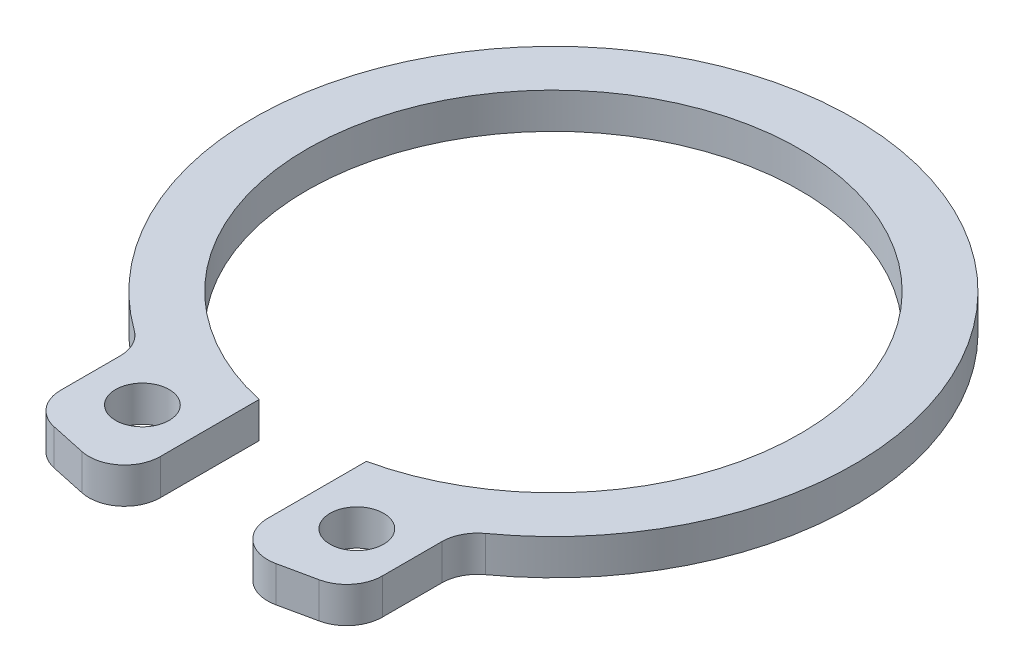
ISO-10303-21;
HEADER;
FILE_DESCRIPTION(('STEP AP214'),'2;1');
FILE_NAME('part.step','',(''),(''),'','','');
FILE_SCHEMA(('AUTOMOTIVE_DESIGN { 1 0 10303 214 1 1 1 1 }'));
ENDSEC;
DATA;
#1=APPLICATION_CONTEXT('core data for automotive mechanical design processes');
#2=APPLICATION_PROTOCOL_DEFINITION('international standard','automotive_design',2000,#1);
#3=PRODUCT_CONTEXT('',#1,'mechanical');
#4=PRODUCT('Part','Part','',(#3));
#5=PRODUCT_RELATED_PRODUCT_CATEGORY('part','',(#4));
#6=PRODUCT_DEFINITION_FORMATION('','',#4);
#7=PRODUCT_DEFINITION_CONTEXT('part definition',#1,'design');
#8=PRODUCT_DEFINITION('design','',#6,#7);
#9=PRODUCT_DEFINITION_SHAPE('','',#8);
#10=(LENGTH_UNIT() NAMED_UNIT(*) SI_UNIT(.MILLI.,.METRE.));
#11=(NAMED_UNIT(*) PLANE_ANGLE_UNIT() SI_UNIT($,.RADIAN.));
#12=(NAMED_UNIT(*) SI_UNIT($,.STERADIAN.) SOLID_ANGLE_UNIT());
#13=UNCERTAINTY_MEASURE_WITH_UNIT(LENGTH_MEASURE(1.E-05),#10,'distance_accuracy_value','');
#14=(GEOMETRIC_REPRESENTATION_CONTEXT(3) GLOBAL_UNCERTAINTY_ASSIGNED_CONTEXT((#13)) GLOBAL_UNIT_ASSIGNED_CONTEXT((#10,
#11,#12)) REPRESENTATION_CONTEXT('',''));
#15=CARTESIAN_POINT('',(0.,0.,0.));
#16=DIRECTION('',(0.,0.,1.));
#17=DIRECTION('',(1.,0.,0.));
#18=AXIS2_PLACEMENT_3D('',#15,#16,#17);
#19=CARTESIAN_POINT('',(0.,1.,0.));
#20=DIRECTION('',(0.,-1.,0.));
#21=DIRECTION('',(0.,0.,-1.));
#22=AXIS2_PLACEMENT_3D('',#19,#20,#21);
#23=CYLINDRICAL_SURFACE('',#22,8.4);
#24=CARTESIAN_POINT('',(0.,1.,0.));
#25=DIRECTION('',(0.,1.,0.));
#26=DIRECTION('',(0.,0.,1.));
#27=AXIS2_PLACEMENT_3D('',#24,#25,#26);
#28=CIRCLE('',#27,8.4);
#29=CARTESIAN_POINT('',(4.91489361702128,1.,6.81203499208302));
#30=VERTEX_POINT('',#29);
#31=CARTESIAN_POINT('',(-4.91489361702127,1.,6.81203499208302));
#32=VERTEX_POINT('',#31);
#33=EDGE_CURVE('E190',#30,#32,#28,.T.);
#34=ORIENTED_EDGE('',*,*,#33,.F.);
#35=DIRECTION('',(0.,-1.,0.));
#36=VECTOR('',#35,1.);
#37=CARTESIAN_POINT('',(4.91489361702128,1.,6.81203499208302));
#38=LINE('',#37,#36);
#39=CARTESIAN_POINT('',(4.91489361702128,0.,6.81203499208302));
#40=VERTEX_POINT('',#39);
#41=EDGE_CURVE('E193',#30,#40,#38,.T.);
#42=ORIENTED_EDGE('',*,*,#41,.T.);
#43=CARTESIAN_POINT('',(0.,0.,0.));
#44=DIRECTION('',(0.,1.,0.));
#45=DIRECTION('',(0.,0.,1.));
#46=AXIS2_PLACEMENT_3D('',#43,#44,#45);
#47=CIRCLE('',#46,8.4);
#48=CARTESIAN_POINT('',(-4.91489361702127,0.,6.81203499208302));
#49=VERTEX_POINT('',#48);
#50=EDGE_CURVE('E169',#40,#49,#47,.T.);
#51=ORIENTED_EDGE('',*,*,#50,.T.);
#52=DIRECTION('',(0.,-1.,0.));
#53=VECTOR('',#52,1.);
#54=CARTESIAN_POINT('',(-4.91489361702127,1.,6.81203499208302));
#55=LINE('',#54,#53);
#56=EDGE_CURVE('E154',#49,#32,#55,.F.);
#57=ORIENTED_EDGE('',*,*,#56,.T.);
#58=EDGE_LOOP('',(#34,#42,#51,#57));
#59=FACE_BOUND('',#58,.T.);
#60=ADVANCED_FACE('F35',(#59),#23,.T.);
#61=CARTESIAN_POINT('',(-4.5,1.,7.09295425052214));
#62=DIRECTION('',(1.,0.,0.));
#63=DIRECTION('',(0.,0.,-1.));
#64=AXIS2_PLACEMENT_3D('',#61,#62,#63);
#65=PLANE('',#64);
#66=DIRECTION('',(0.,0.,1.));
#67=VECTOR('',#66,1.);
#68=CARTESIAN_POINT('',(-4.5,0.,7.09295425052214));
#69=LINE('',#68,#67);
#70=CARTESIAN_POINT('',(-4.5,0.,7.62299153875957));
#71=VERTEX_POINT('',#70);
#72=CARTESIAN_POINT('',(-4.5,0.,9.28432022909111));
#73=VERTEX_POINT('',#72);
#74=EDGE_CURVE('E172',#71,#73,#69,.T.);
#75=ORIENTED_EDGE('',*,*,#74,.T.);
#76=DIRECTION('',(0.,-1.,0.));
#77=VECTOR('',#76,1.);
#78=CARTESIAN_POINT('',(-4.5,1.,9.28432022909111));
#79=LINE('',#78,#77);
#80=CARTESIAN_POINT('',(-4.5,1.,9.28432022909111));
#81=VERTEX_POINT('',#80);
#82=EDGE_CURVE('E232',#73,#81,#79,.F.);
#83=ORIENTED_EDGE('',*,*,#82,.T.);
#84=DIRECTION('',(0.,0.,1.));
#85=VECTOR('',#84,1.);
#86=CARTESIAN_POINT('',(-4.5,1.,7.09295425052214));
#87=LINE('',#86,#85);
#88=CARTESIAN_POINT('',(-4.5,1.,7.62299153875957));
#89=VERTEX_POINT('',#88);
#90=EDGE_CURVE('E252',#89,#81,#87,.T.);
#91=ORIENTED_EDGE('',*,*,#90,.F.);
#92=DIRECTION('',(0.,1.,0.));
#93=VECTOR('',#92,1.);
#94=CARTESIAN_POINT('',(-4.5,0.,7.62299153875957));
#95=LINE('',#94,#93);
#96=EDGE_CURVE('E229',#89,#71,#95,.F.);
#97=ORIENTED_EDGE('',*,*,#96,.T.);
#98=EDGE_LOOP('',(#75,#83,#91,#97));
#99=FACE_BOUND('',#98,.T.);
#100=ADVANCED_FACE('F255',(#99),#65,.F.);
#101=CARTESIAN_POINT('',(-4.5,1.,10.0929542505221));
#102=DIRECTION('',(0.209271011198973,0.,-0.977857680785788));
#103=DIRECTION('',(-0.977857680785788,0.,-0.209271011198973));
#104=AXIS2_PLACEMENT_3D('',#101,#102,#103);
#105=PLANE('',#104);
#106=DIRECTION('',(0.977857680785788,0.,0.209271011198973));
#107=VECTOR('',#106,1.);
#108=CARTESIAN_POINT('',(-4.5,0.,10.0929542505221));
#109=LINE('',#108,#107);
#110=CARTESIAN_POINT('',(-3.70927101119897,0.,10.2621779098769));
#111=VERTEX_POINT('',#110);
#112=CARTESIAN_POINT('',(-2.70927101119897,0.,10.4761875917672));
#113=VERTEX_POINT('',#112);
#114=EDGE_CURVE('E176',#111,#113,#109,.T.);
#115=ORIENTED_EDGE('',*,*,#114,.T.);
#116=DIRECTION('',(0.,-1.,0.));
#117=VECTOR('',#116,1.);
#118=CARTESIAN_POINT('',(-2.70927101119897,1.,10.4761875917672));
#119=LINE('',#118,#117);
#120=CARTESIAN_POINT('',(-2.70927101119897,1.,10.4761875917672));
#121=VERTEX_POINT('',#120);
#122=EDGE_CURVE('E227',#113,#121,#119,.F.);
#123=ORIENTED_EDGE('',*,*,#122,.T.);
#124=DIRECTION('',(0.977857680785788,0.,0.209271011198973));
#125=VECTOR('',#124,1.);
#126=CARTESIAN_POINT('',(-4.5,1.,10.0929542505221));
#127=LINE('',#126,#125);
#128=CARTESIAN_POINT('',(-3.70927101119897,1.,10.2621779098769));
#129=VERTEX_POINT('',#128);
#130=EDGE_CURVE('E145',#129,#121,#127,.T.);
#131=ORIENTED_EDGE('',*,*,#130,.F.);
#132=DIRECTION('',(0.,-1.,0.));
#133=VECTOR('',#132,1.);
#134=CARTESIAN_POINT('',(-3.70927101119897,1.,10.2621779098769));
#135=LINE('',#134,#133);
#136=EDGE_CURVE('E224',#129,#111,#135,.T.);
#137=ORIENTED_EDGE('',*,*,#136,.T.);
#138=EDGE_LOOP('',(#115,#123,#131,#137));
#139=FACE_BOUND('',#138,.T.);
#140=ADVANCED_FACE('F301',(#139),#105,.F.);
#141=CARTESIAN_POINT('',(-1.5,1.,10.7349832961931));
#142=DIRECTION('',(-1.,0.,0.));
#143=DIRECTION('',(0.,0.,1.));
#144=AXIS2_PLACEMENT_3D('',#141,#142,#143);
#145=PLANE('',#144);
#146=DIRECTION('',(0.,0.,-1.));
#147=VECTOR('',#146,1.);
#148=CARTESIAN_POINT('',(-1.5,1.,10.7349832961931));
#149=LINE('',#148,#147);
#150=CARTESIAN_POINT('',(-1.5,1.,9.49832991098143));
#151=VERTEX_POINT('',#150);
#152=CARTESIAN_POINT('',(-1.5,1.,6.7349832961931));
#153=VERTEX_POINT('',#152);
#154=EDGE_CURVE('E135',#151,#153,#149,.T.);
#155=ORIENTED_EDGE('',*,*,#154,.F.);
#156=DIRECTION('',(0.,-1.,0.));
#157=VECTOR('',#156,1.);
#158=CARTESIAN_POINT('',(-1.5,1.,9.49832991098143));
#159=LINE('',#158,#157);
#160=CARTESIAN_POINT('',(-1.5,0.,9.49832991098143));
#161=VERTEX_POINT('',#160);
#162=EDGE_CURVE('E222',#151,#161,#159,.T.);
#163=ORIENTED_EDGE('',*,*,#162,.T.);
#164=DIRECTION('',(0.,0.,-1.));
#165=VECTOR('',#164,1.);
#166=CARTESIAN_POINT('',(-1.5,0.,10.7349832961931));
#167=LINE('',#166,#165);
#168=CARTESIAN_POINT('',(-1.5,0.,6.7349832961931));
#169=VERTEX_POINT('',#168);
#170=EDGE_CURVE('E151',#161,#169,#167,.T.);
#171=ORIENTED_EDGE('',*,*,#170,.T.);
#172=DIRECTION('',(0.,-1.,0.));
#173=VECTOR('',#172,1.);
#174=CARTESIAN_POINT('',(-1.5,1.,6.7349832961931));
#175=LINE('',#174,#173);
#176=EDGE_CURVE('E148',#153,#169,#175,.T.);
#177=ORIENTED_EDGE('',*,*,#176,.F.);
#178=EDGE_LOOP('',(#155,#163,#171,#177));
#179=FACE_BOUND('',#178,.T.);
#180=ADVANCED_FACE('F149',(#179),#145,.F.);
#181=CARTESIAN_POINT('',(0.,1.,0.));
#182=DIRECTION('',(0.,-1.,0.));
#183=DIRECTION('',(0.,0.,-1.));
#184=AXIS2_PLACEMENT_3D('',#181,#182,#183);
#185=CYLINDRICAL_SURFACE('',#184,6.9);
#186=CARTESIAN_POINT('',(0.,0.,0.));
#187=DIRECTION('',(0.,-1.,0.));
#188=DIRECTION('',(0.,0.,1.));
#189=AXIS2_PLACEMENT_3D('',#186,#187,#188);
#190=CIRCLE('',#189,6.9);
#191=CARTESIAN_POINT('',(1.5,0.,6.73498329619309));
#192=VERTEX_POINT('',#191);
#193=EDGE_CURVE('E180',#169,#192,#190,.T.);
#194=ORIENTED_EDGE('',*,*,#193,.T.);
#195=DIRECTION('',(0.,-1.,0.));
#196=VECTOR('',#195,1.);
#197=CARTESIAN_POINT('',(1.5,1.,6.73498329619309));
#198=LINE('',#197,#196);
#199=CARTESIAN_POINT('',(1.5,1.,6.73498329619309));
#200=VERTEX_POINT('',#199);
#201=EDGE_CURVE('E155',#200,#192,#198,.T.);
#202=ORIENTED_EDGE('',*,*,#201,.F.);
#203=CARTESIAN_POINT('',(0.,1.,0.));
#204=DIRECTION('',(0.,-1.,0.));
#205=DIRECTION('',(0.,0.,1.));
#206=AXIS2_PLACEMENT_3D('',#203,#204,#205);
#207=CIRCLE('',#206,6.9);
#208=EDGE_CURVE('E140',#153,#200,#207,.T.);
#209=ORIENTED_EDGE('',*,*,#208,.F.);
#210=ORIENTED_EDGE('',*,*,#176,.T.);
#211=EDGE_LOOP('',(#194,#202,#209,#210));
#212=FACE_BOUND('',#211,.T.);
#213=ADVANCED_FACE('F157',(#212),#185,.F.);
#214=CARTESIAN_POINT('',(1.5,1.,10.7349832961931));
#215=DIRECTION('',(1.,0.,0.));
#216=DIRECTION('',(0.,0.,-1.));
#217=AXIS2_PLACEMENT_3D('',#214,#215,#216);
#218=PLANE('',#217);
#219=DIRECTION('',(0.,0.,1.));
#220=VECTOR('',#219,1.);
#221=CARTESIAN_POINT('',(1.5,0.,10.7349832961931));
#222=LINE('',#221,#220);
#223=CARTESIAN_POINT('',(1.5,0.,9.49832991098143));
#224=VERTEX_POINT('',#223);
#225=EDGE_CURVE('E182',#192,#224,#222,.T.);
#226=ORIENTED_EDGE('',*,*,#225,.T.);
#227=DIRECTION('',(0.,-1.,0.));
#228=VECTOR('',#227,1.);
#229=CARTESIAN_POINT('',(1.5,1.,9.49832991098143));
#230=LINE('',#229,#228);
#231=CARTESIAN_POINT('',(1.5,1.,9.49832991098143));
#232=VERTEX_POINT('',#231);
#233=EDGE_CURVE('E50',#224,#232,#230,.F.);
#234=ORIENTED_EDGE('',*,*,#233,.T.);
#235=DIRECTION('',(0.,0.,1.));
#236=VECTOR('',#235,1.);
#237=CARTESIAN_POINT('',(1.5,1.,10.7349832961931));
#238=LINE('',#237,#236);
#239=EDGE_CURVE('E159',#200,#232,#238,.T.);
#240=ORIENTED_EDGE('',*,*,#239,.F.);
#241=ORIENTED_EDGE('',*,*,#201,.T.);
#242=EDGE_LOOP('',(#226,#234,#240,#241));
#243=FACE_BOUND('',#242,.T.);
#244=ADVANCED_FACE('F331',(#243),#218,.F.);
#245=CARTESIAN_POINT('',(4.5,1.,10.0929542505221));
#246=DIRECTION('',(-0.209271011198973,0.,-0.977857680785788));
#247=DIRECTION('',(-0.977857680785787,0.,0.209271011198973));
#248=AXIS2_PLACEMENT_3D('',#245,#246,#247);
#249=PLANE('',#248);
#250=DIRECTION('',(0.977857680785788,0.,-0.209271011198973));
#251=VECTOR('',#250,1.);
#252=CARTESIAN_POINT('',(4.5,0.,10.0929542505221));
#253=LINE('',#252,#251);
#254=CARTESIAN_POINT('',(2.70927101119897,0.,10.4761875917672));
#255=VERTEX_POINT('',#254);
#256=CARTESIAN_POINT('',(3.70927101119897,0.,10.2621779098769));
#257=VERTEX_POINT('',#256);
#258=EDGE_CURVE('E184',#255,#257,#253,.T.);
#259=ORIENTED_EDGE('',*,*,#258,.T.);
#260=DIRECTION('',(0.,-1.,0.));
#261=VECTOR('',#260,1.);
#262=CARTESIAN_POINT('',(3.70927101119897,1.,10.2621779098769));
#263=LINE('',#262,#261);
#264=CARTESIAN_POINT('',(3.70927101119897,1.,10.2621779098769));
#265=VERTEX_POINT('',#264);
#266=EDGE_CURVE('E212',#257,#265,#263,.F.);
#267=ORIENTED_EDGE('',*,*,#266,.T.);
#268=DIRECTION('',(0.977857680785788,0.,-0.209271011198973));
#269=VECTOR('',#268,1.);
#270=CARTESIAN_POINT('',(4.5,1.,10.0929542505221));
#271=LINE('',#270,#269);
#272=CARTESIAN_POINT('',(2.70927101119897,1.,10.4761875917672));
#273=VERTEX_POINT('',#272);
#274=EDGE_CURVE('E161',#273,#265,#271,.T.);
#275=ORIENTED_EDGE('',*,*,#274,.F.);
#276=DIRECTION('',(0.,-1.,0.));
#277=VECTOR('',#276,1.);
#278=CARTESIAN_POINT('',(2.70927101119897,1.,10.4761875917672));
#279=LINE('',#278,#277);
#280=EDGE_CURVE('E209',#273,#255,#279,.T.);
#281=ORIENTED_EDGE('',*,*,#280,.T.);
#282=EDGE_LOOP('',(#259,#267,#275,#281));
#283=FACE_BOUND('',#282,.T.);
#284=ADVANCED_FACE('F337',(#283),#249,.F.);
#285=CARTESIAN_POINT('',(4.5,1.,7.09295425052214));
#286=DIRECTION('',(-1.,0.,0.));
#287=DIRECTION('',(0.,0.,1.));
#288=AXIS2_PLACEMENT_3D('',#285,#286,#287);
#289=PLANE('',#288);
#290=DIRECTION('',(0.,0.,-1.));
#291=VECTOR('',#290,1.);
#292=CARTESIAN_POINT('',(4.5,0.,7.09295425052214));
#293=LINE('',#292,#291);
#294=CARTESIAN_POINT('',(4.5,0.,9.28432022909111));
#295=VERTEX_POINT('',#294);
#296=CARTESIAN_POINT('',(4.5,0.,7.62299153875957));
#297=VERTEX_POINT('',#296);
#298=EDGE_CURVE('E187',#295,#297,#293,.T.);
#299=ORIENTED_EDGE('',*,*,#298,.T.);
#300=DIRECTION('',(0.,1.,0.));
#301=VECTOR('',#300,1.);
#302=CARTESIAN_POINT('',(4.5,1.,7.62299153875957));
#303=LINE('',#302,#301);
#304=CARTESIAN_POINT('',(4.5,1.,7.62299153875957));
#305=VERTEX_POINT('',#304);
#306=EDGE_CURVE('E199',#297,#305,#303,.T.);
#307=ORIENTED_EDGE('',*,*,#306,.T.);
#308=DIRECTION('',(0.,0.,-1.));
#309=VECTOR('',#308,1.);
#310=CARTESIAN_POINT('',(4.5,1.,7.09295425052214));
#311=LINE('',#310,#309);
#312=CARTESIAN_POINT('',(4.5,1.,9.28432022909111));
#313=VERTEX_POINT('',#312);
#314=EDGE_CURVE('E166',#313,#305,#311,.T.);
#315=ORIENTED_EDGE('',*,*,#314,.F.);
#316=DIRECTION('',(0.,-1.,0.));
#317=VECTOR('',#316,1.);
#318=CARTESIAN_POINT('',(4.5,1.,9.28432022909111));
#319=LINE('',#318,#317);
#320=EDGE_CURVE('E196',#313,#295,#319,.T.);
#321=ORIENTED_EDGE('',*,*,#320,.T.);
#322=EDGE_LOOP('',(#299,#307,#315,#321));
#323=FACE_BOUND('',#322,.T.);
#324=ADVANCED_FACE('F284',(#323),#289,.F.);
#325=CARTESIAN_POINT('',(0.,1.,0.));
#326=DIRECTION('',(0.,1.,0.));
#327=DIRECTION('',(0.,0.,1.));
#328=AXIS2_PLACEMENT_3D('',#325,#326,#327);
#329=PLANE('',#328);
#330=CARTESIAN_POINT('',(-3.,1.,8.5));
#331=DIRECTION('',(0.,1.,0.));
#332=DIRECTION('',(0.,0.,1.));
#333=AXIS2_PLACEMENT_3D('',#330,#331,#332);
#334=CIRCLE('',#333,0.75);
#335=CARTESIAN_POINT('',(-3.,1.,9.25));
#336=VERTEX_POINT('',#335);
#337=EDGE_CURVE('E266',#336,#336,#334,.T.);
#338=ORIENTED_EDGE('',*,*,#337,.F.);
#339=EDGE_LOOP('',(#338));
#340=FACE_BOUND('',#339,.T.);
#341=CARTESIAN_POINT('',(3.,1.,8.5));
#342=DIRECTION('',(0.,1.,0.));
#343=DIRECTION('',(0.,0.,-1.));
#344=AXIS2_PLACEMENT_3D('',#341,#342,#343);
#345=CIRCLE('',#344,0.75);
#346=CARTESIAN_POINT('',(3.,1.,7.75));
#347=VERTEX_POINT('',#346);
#348=EDGE_CURVE('E260',#347,#347,#345,.T.);
#349=ORIENTED_EDGE('',*,*,#348,.F.);
#350=EDGE_LOOP('',(#349));
#351=FACE_BOUND('',#350,.T.);
#352=ORIENTED_EDGE('',*,*,#274,.T.);
#353=CARTESIAN_POINT('',(3.5,1.,9.28432022909111));
#354=DIRECTION('',(0.,1.,0.));
#355=DIRECTION('',(0.,0.,1.));
#356=AXIS2_PLACEMENT_3D('',#353,#354,#355);
#357=CIRCLE('',#356,1.);
#358=EDGE_CURVE('E219',#265,#313,#357,.T.);
#359=ORIENTED_EDGE('',*,*,#358,.T.);
#360=ORIENTED_EDGE('',*,*,#314,.T.);
#361=CARTESIAN_POINT('',(5.5,1.,7.62299153875957));
#362=DIRECTION('',(0.,1.,0.));
#363=DIRECTION('',(0.,0.,1.));
#364=AXIS2_PLACEMENT_3D('',#361,#362,#363);
#365=CIRCLE('',#364,1.);
#366=EDGE_CURVE('E236',#305,#30,#365,.F.);
#367=ORIENTED_EDGE('',*,*,#366,.T.);
#368=ORIENTED_EDGE('',*,*,#33,.T.);
#369=CARTESIAN_POINT('',(-5.5,1.,7.62299153875957));
#370=DIRECTION('',(0.,1.,0.));
#371=DIRECTION('',(0.,0.,1.));
#372=AXIS2_PLACEMENT_3D('',#369,#370,#371);
#373=CIRCLE('',#372,1.);
#374=EDGE_CURVE('E11',#32,#89,#373,.F.);
#375=ORIENTED_EDGE('',*,*,#374,.T.);
#376=ORIENTED_EDGE('',*,*,#90,.T.);
#377=CARTESIAN_POINT('',(-3.5,1.,9.28432022909111));
#378=DIRECTION('',(0.,1.,0.));
#379=DIRECTION('',(0.,0.,1.));
#380=AXIS2_PLACEMENT_3D('',#377,#378,#379);
#381=CIRCLE('',#380,1.);
#382=EDGE_CURVE('E214',#81,#129,#381,.T.);
#383=ORIENTED_EDGE('',*,*,#382,.T.);
#384=ORIENTED_EDGE('',*,*,#130,.T.);
#385=CARTESIAN_POINT('',(-2.5,1.,9.49832991098143));
#386=DIRECTION('',(0.,1.,0.));
#387=DIRECTION('',(0.,0.,1.));
#388=AXIS2_PLACEMENT_3D('',#385,#386,#387);
#389=CIRCLE('',#388,1.);
#390=EDGE_CURVE('E58',#121,#151,#389,.T.);
#391=ORIENTED_EDGE('',*,*,#390,.T.);
#392=ORIENTED_EDGE('',*,*,#154,.T.);
#393=ORIENTED_EDGE('',*,*,#208,.T.);
#394=ORIENTED_EDGE('',*,*,#239,.T.);
#395=CARTESIAN_POINT('',(2.5,1.,9.49832991098143));
#396=DIRECTION('',(0.,1.,0.));
#397=DIRECTION('',(0.,0.,1.));
#398=AXIS2_PLACEMENT_3D('',#395,#396,#397);
#399=CIRCLE('',#398,1.);
#400=EDGE_CURVE('E217',#232,#273,#399,.T.);
#401=ORIENTED_EDGE('',*,*,#400,.T.);
#402=EDGE_LOOP('',(#352,#359,#360,#367,#368,#375,#376,#383,#384,#391,#392,#393,#394,#401));
#403=FACE_BOUND('',#402,.T.);
#404=ADVANCED_FACE('F138',(#340,#351,#403),#329,.T.);
#405=CARTESIAN_POINT('',(0.,0.,0.));
#406=DIRECTION('',(0.,1.,0.));
#407=DIRECTION('',(0.,0.,1.));
#408=AXIS2_PLACEMENT_3D('',#405,#406,#407);
#409=PLANE('',#408);
#410=CARTESIAN_POINT('',(-3.,0.,8.5));
#411=DIRECTION('',(0.,1.,0.));
#412=DIRECTION('',(0.,0.,1.));
#413=AXIS2_PLACEMENT_3D('',#410,#411,#412);
#414=CIRCLE('',#413,0.75);
#415=CARTESIAN_POINT('',(-3.,0.,9.25));
#416=VERTEX_POINT('',#415);
#417=EDGE_CURVE('E173',#416,#416,#414,.T.);
#418=ORIENTED_EDGE('',*,*,#417,.T.);
#419=EDGE_LOOP('',(#418));
#420=FACE_BOUND('',#419,.T.);
#421=CARTESIAN_POINT('',(3.,0.,8.5));
#422=DIRECTION('',(0.,1.,0.));
#423=DIRECTION('',(0.,0.,-1.));
#424=AXIS2_PLACEMENT_3D('',#421,#422,#423);
#425=CIRCLE('',#424,0.75);
#426=CARTESIAN_POINT('',(3.,0.,7.75));
#427=VERTEX_POINT('',#426);
#428=EDGE_CURVE('E263',#427,#427,#425,.T.);
#429=ORIENTED_EDGE('',*,*,#428,.T.);
#430=EDGE_LOOP('',(#429));
#431=FACE_BOUND('',#430,.T.);
#432=ORIENTED_EDGE('',*,*,#298,.F.);
#433=CARTESIAN_POINT('',(3.5,0.,9.28432022909111));
#434=DIRECTION('',(0.,1.,0.));
#435=DIRECTION('',(0.,0.,1.));
#436=AXIS2_PLACEMENT_3D('',#433,#434,#435);
#437=CIRCLE('',#436,1.);
#438=EDGE_CURVE('E207',#295,#257,#437,.F.);
#439=ORIENTED_EDGE('',*,*,#438,.T.);
#440=ORIENTED_EDGE('',*,*,#258,.F.);
#441=CARTESIAN_POINT('',(2.5,0.,9.49832991098143));
#442=DIRECTION('',(0.,1.,0.));
#443=DIRECTION('',(0.,0.,1.));
#444=AXIS2_PLACEMENT_3D('',#441,#442,#443);
#445=CIRCLE('',#444,1.);
#446=EDGE_CURVE('E205',#255,#224,#445,.F.);
#447=ORIENTED_EDGE('',*,*,#446,.T.);
#448=ORIENTED_EDGE('',*,*,#225,.F.);
#449=ORIENTED_EDGE('',*,*,#193,.F.);
#450=ORIENTED_EDGE('',*,*,#170,.F.);
#451=CARTESIAN_POINT('',(-2.5,0.,9.49832991098143));
#452=DIRECTION('',(0.,1.,0.));
#453=DIRECTION('',(0.,0.,1.));
#454=AXIS2_PLACEMENT_3D('',#451,#452,#453);
#455=CIRCLE('',#454,1.);
#456=EDGE_CURVE('E203',#161,#113,#455,.F.);
#457=ORIENTED_EDGE('',*,*,#456,.T.);
#458=ORIENTED_EDGE('',*,*,#114,.F.);
#459=CARTESIAN_POINT('',(-3.5,0.,9.28432022909111));
#460=DIRECTION('',(0.,1.,0.));
#461=DIRECTION('',(0.,0.,1.));
#462=AXIS2_PLACEMENT_3D('',#459,#460,#461);
#463=CIRCLE('',#462,1.);
#464=EDGE_CURVE('E201',#111,#73,#463,.F.);
#465=ORIENTED_EDGE('',*,*,#464,.T.);
#466=ORIENTED_EDGE('',*,*,#74,.F.);
#467=CARTESIAN_POINT('',(-5.5,0.,7.62299153875957));
#468=DIRECTION('',(0.,1.,0.));
#469=DIRECTION('',(0.,0.,1.));
#470=AXIS2_PLACEMENT_3D('',#467,#468,#469);
#471=CIRCLE('',#470,1.);
#472=EDGE_CURVE('E43',#71,#49,#471,.T.);
#473=ORIENTED_EDGE('',*,*,#472,.T.);
#474=ORIENTED_EDGE('',*,*,#50,.F.);
#475=CARTESIAN_POINT('',(5.5,0.,7.62299153875957));
#476=DIRECTION('',(0.,1.,0.));
#477=DIRECTION('',(0.,0.,1.));
#478=AXIS2_PLACEMENT_3D('',#475,#476,#477);
#479=CIRCLE('',#478,1.);
#480=EDGE_CURVE('E234',#40,#297,#479,.T.);
#481=ORIENTED_EDGE('',*,*,#480,.T.);
#482=EDGE_LOOP('',(#432,#439,#440,#447,#448,#449,#450,#457,#458,#465,#466,#473,#474,#481));
#483=FACE_BOUND('',#482,.T.);
#484=ADVANCED_FACE('F241',(#420,#431,#483),#409,.F.);
#485=CARTESIAN_POINT('',(3.,0.,8.5));
#486=DIRECTION('',(0.,1.,0.));
#487=DIRECTION('',(0.,0.,1.));
#488=AXIS2_PLACEMENT_3D('',#485,#486,#487);
#489=CYLINDRICAL_SURFACE('',#488,0.75);
#490=ORIENTED_EDGE('',*,*,#428,.F.);
#491=EDGE_LOOP('',(#490));
#492=FACE_BOUND('',#491,.T.);
#493=ORIENTED_EDGE('',*,*,#348,.T.);
#494=EDGE_LOOP('',(#493));
#495=FACE_BOUND('',#494,.T.);
#496=ADVANCED_FACE('F278',(#492,#495),#489,.F.);
#497=CARTESIAN_POINT('',(-3.,0.,8.5));
#498=DIRECTION('',(0.,1.,0.));
#499=DIRECTION('',(0.,0.,1.));
#500=AXIS2_PLACEMENT_3D('',#497,#498,#499);
#501=CYLINDRICAL_SURFACE('',#500,0.75);
#502=ORIENTED_EDGE('',*,*,#417,.F.);
#503=EDGE_LOOP('',(#502));
#504=FACE_BOUND('',#503,.T.);
#505=ORIENTED_EDGE('',*,*,#337,.T.);
#506=EDGE_LOOP('',(#505));
#507=FACE_BOUND('',#506,.T.);
#508=ADVANCED_FACE('F274',(#504,#507),#501,.F.);
#509=CARTESIAN_POINT('',(5.5,1.,7.62299153875957));
#510=DIRECTION('',(0.,-1.,0.));
#511=DIRECTION('',(0.,0.,-1.));
#512=AXIS2_PLACEMENT_3D('',#509,#510,#511);
#513=CYLINDRICAL_SURFACE('',#512,1.);
#514=ORIENTED_EDGE('',*,*,#366,.F.);
#515=ORIENTED_EDGE('',*,*,#306,.F.);
#516=ORIENTED_EDGE('',*,*,#480,.F.);
#517=ORIENTED_EDGE('',*,*,#41,.F.);
#518=EDGE_LOOP('',(#514,#515,#516,#517));
#519=FACE_BOUND('',#518,.T.);
#520=ADVANCED_FACE('F277',(#519),#513,.F.);
#521=CARTESIAN_POINT('',(3.5,1.,9.28432022909111));
#522=DIRECTION('',(0.,-1.,0.));
#523=DIRECTION('',(0.,0.,-1.));
#524=AXIS2_PLACEMENT_3D('',#521,#522,#523);
#525=CYLINDRICAL_SURFACE('',#524,1.);
#526=ORIENTED_EDGE('',*,*,#358,.F.);
#527=ORIENTED_EDGE('',*,*,#266,.F.);
#528=ORIENTED_EDGE('',*,*,#438,.F.);
#529=ORIENTED_EDGE('',*,*,#320,.F.);
#530=EDGE_LOOP('',(#526,#527,#528,#529));
#531=FACE_BOUND('',#530,.T.);
#532=ADVANCED_FACE('F307',(#531),#525,.T.);
#533=CARTESIAN_POINT('',(2.5,1.,9.49832991098143));
#534=DIRECTION('',(0.,-1.,0.));
#535=DIRECTION('',(0.,0.,-1.));
#536=AXIS2_PLACEMENT_3D('',#533,#534,#535);
#537=CYLINDRICAL_SURFACE('',#536,1.);
#538=ORIENTED_EDGE('',*,*,#400,.F.);
#539=ORIENTED_EDGE('',*,*,#233,.F.);
#540=ORIENTED_EDGE('',*,*,#446,.F.);
#541=ORIENTED_EDGE('',*,*,#280,.F.);
#542=EDGE_LOOP('',(#538,#539,#540,#541));
#543=FACE_BOUND('',#542,.T.);
#544=ADVANCED_FACE('F311',(#543),#537,.T.);
#545=CARTESIAN_POINT('',(-2.5,1.,9.49832991098143));
#546=DIRECTION('',(0.,-1.,0.));
#547=DIRECTION('',(0.,0.,-1.));
#548=AXIS2_PLACEMENT_3D('',#545,#546,#547);
#549=CYLINDRICAL_SURFACE('',#548,1.);
#550=ORIENTED_EDGE('',*,*,#390,.F.);
#551=ORIENTED_EDGE('',*,*,#122,.F.);
#552=ORIENTED_EDGE('',*,*,#456,.F.);
#553=ORIENTED_EDGE('',*,*,#162,.F.);
#554=EDGE_LOOP('',(#550,#551,#552,#553));
#555=FACE_BOUND('',#554,.T.);
#556=ADVANCED_FACE('F315',(#555),#549,.T.);
#557=CARTESIAN_POINT('',(-3.5,1.,9.28432022909111));
#558=DIRECTION('',(0.,-1.,0.));
#559=DIRECTION('',(0.,0.,-1.));
#560=AXIS2_PLACEMENT_3D('',#557,#558,#559);
#561=CYLINDRICAL_SURFACE('',#560,1.);
#562=ORIENTED_EDGE('',*,*,#382,.F.);
#563=ORIENTED_EDGE('',*,*,#82,.F.);
#564=ORIENTED_EDGE('',*,*,#464,.F.);
#565=ORIENTED_EDGE('',*,*,#136,.F.);
#566=EDGE_LOOP('',(#562,#563,#564,#565));
#567=FACE_BOUND('',#566,.T.);
#568=ADVANCED_FACE('F318',(#567),#561,.T.);
#569=CARTESIAN_POINT('',(-5.5,1.,7.62299153875957));
#570=DIRECTION('',(0.,-1.,0.));
#571=DIRECTION('',(0.,0.,-1.));
#572=AXIS2_PLACEMENT_3D('',#569,#570,#571);
#573=CYLINDRICAL_SURFACE('',#572,1.);
#574=ORIENTED_EDGE('',*,*,#374,.F.);
#575=ORIENTED_EDGE('',*,*,#56,.F.);
#576=ORIENTED_EDGE('',*,*,#472,.F.);
#577=ORIENTED_EDGE('',*,*,#96,.F.);
#578=EDGE_LOOP('',(#574,#575,#576,#577));
#579=FACE_BOUND('',#578,.T.);
#580=ADVANCED_FACE('F37',(#579),#573,.F.);
#581=CLOSED_SHELL('',(#60,#100,#140,#180,#213,#244,#284,#324,#404,#484,#496,#508,#520,#532,#544,
#556,#568,#580));
#582=MANIFOLD_SOLID_BREP('B2',#581);
#583=ADVANCED_BREP_SHAPE_REPRESENTATION('',(#18,#582),#14);
#584=SHAPE_DEFINITION_REPRESENTATION(#9,#583);
ENDSEC;
END-ISO-10303-21;
